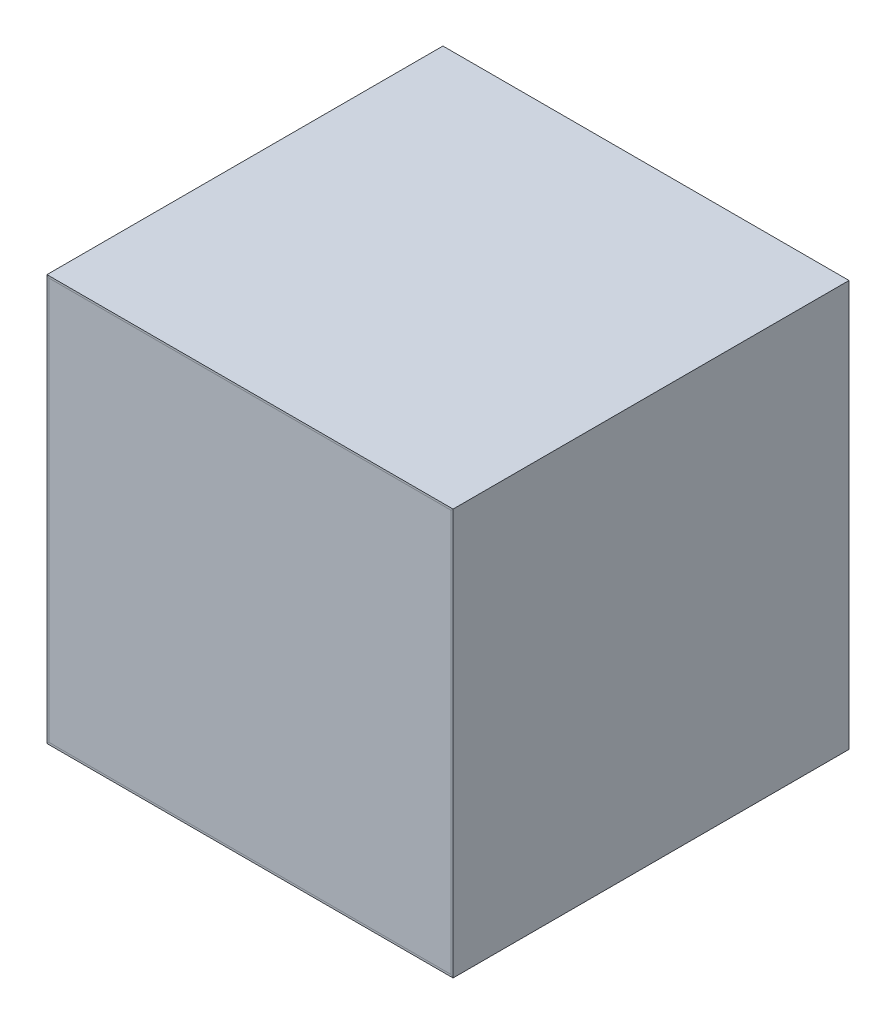
ISO-10303-21;
HEADER;
FILE_DESCRIPTION(('STEP AP214'),'2;1');
FILE_NAME('part.step','',(''),(''),'','','');
FILE_SCHEMA(('AUTOMOTIVE_DESIGN { 1 0 10303 214 1 1 1 1 }'));
ENDSEC;
DATA;
#1=APPLICATION_CONTEXT('core data for automotive mechanical design processes');
#2=APPLICATION_PROTOCOL_DEFINITION('international standard','automotive_design',2000,#1);
#3=PRODUCT_CONTEXT('',#1,'mechanical');
#4=PRODUCT('Part','Part','',(#3));
#5=PRODUCT_RELATED_PRODUCT_CATEGORY('part','',(#4));
#6=PRODUCT_DEFINITION_FORMATION('','',#4);
#7=PRODUCT_DEFINITION_CONTEXT('part definition',#1,'design');
#8=PRODUCT_DEFINITION('design','',#6,#7);
#9=PRODUCT_DEFINITION_SHAPE('','',#8);
#10=(LENGTH_UNIT() NAMED_UNIT(*) SI_UNIT(.MILLI.,.METRE.));
#11=(NAMED_UNIT(*) PLANE_ANGLE_UNIT() SI_UNIT($,.RADIAN.));
#12=(NAMED_UNIT(*) SI_UNIT($,.STERADIAN.) SOLID_ANGLE_UNIT());
#13=UNCERTAINTY_MEASURE_WITH_UNIT(LENGTH_MEASURE(1.E-05),#10,'distance_accuracy_value','');
#14=(GEOMETRIC_REPRESENTATION_CONTEXT(3) GLOBAL_UNCERTAINTY_ASSIGNED_CONTEXT((#13)) GLOBAL_UNIT_ASSIGNED_CONTEXT((#10,
#11,#12)) REPRESENTATION_CONTEXT('',''));
#15=CARTESIAN_POINT('',(0.,0.,0.));
#16=DIRECTION('',(0.,0.,1.));
#17=DIRECTION('',(1.,0.,0.));
#18=AXIS2_PLACEMENT_3D('',#15,#16,#17);
#19=CARTESIAN_POINT('',(299.538430706453,-299.538430706453,-9.67963308426285E-13));
#20=DIRECTION('',(0.707106781186547,-0.707106781186548,0.));
#21=DIRECTION('',(0.707106781186548,0.707106781186547,0.));
#22=AXIS2_PLACEMENT_3D('',#19,#20,#21);
#23=PLANE('',#22);
#24=DIRECTION('',(-0.707106781186548,-0.707106781186547,0.));
#25=VECTOR('',#24,1.);
#26=CARTESIAN_POINT('',(299.538430706453,-299.538430706453,25.0000000000121));
#27=LINE('',#26,#25);
#28=CARTESIAN_POINT('',(1099.47361403625,500.396752623344,25.0000000000121));
#29=VERTEX_POINT('',#28);
#30=CARTESIAN_POINT('',(1094.47361403625,495.396752623344,25.0000000000121));
#31=VERTEX_POINT('',#30);
#32=EDGE_CURVE('E145',#29,#31,#27,.T.);
#33=ORIENTED_EDGE('',*,*,#32,.F.);
#34=DIRECTION('',(0.,0.,1.));
#35=VECTOR('',#34,1.);
#36=CARTESIAN_POINT('',(1099.47361403625,500.396752623344,25.0000000000121));
#37=LINE('',#36,#35);
#38=CARTESIAN_POINT('',(1099.47361403625,500.396752623344,1000.00000000001));
#39=VERTEX_POINT('',#38);
#40=EDGE_CURVE('E135',#29,#39,#37,.T.);
#41=ORIENTED_EDGE('',*,*,#40,.T.);
#42=DIRECTION('',(-0.707106781186548,-0.707106781186547,0.));
#43=VECTOR('',#42,1.);
#44=CARTESIAN_POINT('',(299.538430706455,-299.538430706455,1000.00000000001));
#45=LINE('',#44,#43);
#46=CARTESIAN_POINT('',(1094.47361403625,495.396752623344,1000.00000000001));
#47=VERTEX_POINT('',#46);
#48=EDGE_CURVE('E125',#39,#47,#45,.T.);
#49=ORIENTED_EDGE('',*,*,#48,.T.);
#50=DIRECTION('',(0.,0.,1.));
#51=VECTOR('',#50,1.);
#52=CARTESIAN_POINT('',(1094.47361403625,495.396752623344,25.0000000000121));
#53=LINE('',#52,#51);
#54=EDGE_CURVE('E84',#31,#47,#53,.T.);
#55=ORIENTED_EDGE('',*,*,#54,.F.);
#56=EDGE_LOOP('',(#33,#41,#49,#55));
#57=FACE_BOUND('',#56,.T.);
#58=ADVANCED_FACE('F80',(#57),#23,.T.);
#59=CARTESIAN_POINT('',(299.973285714792,299.973285714792,1.05516752023136E-12));
#60=DIRECTION('',(-0.707106781186548,-0.707106781186547,0.));
#61=DIRECTION('',(0.707106781186547,-0.707106781186548,0.));
#62=AXIS2_PLACEMENT_3D('',#59,#60,#61);
#63=PLANE('',#62);
#64=DIRECTION('',(-0.707106781186547,0.707106781186548,0.));
#65=VECTOR('',#64,1.);
#66=CARTESIAN_POINT('',(299.97328571479,299.97328571479,1000.00000000001));
#67=LINE('',#66,#65);
#68=CARTESIAN_POINT('',(104.549818806238,495.396752623344,1000.00000000001));
#69=VERTEX_POINT('',#68);
#70=CARTESIAN_POINT('',(99.5498188062385,500.396752623344,1000.00000000001));
#71=VERTEX_POINT('',#70);
#72=EDGE_CURVE('E124',#69,#71,#67,.T.);
#73=ORIENTED_EDGE('',*,*,#72,.T.);
#74=DIRECTION('',(0.,0.,-1.));
#75=VECTOR('',#74,1.);
#76=CARTESIAN_POINT('',(99.5498188062401,500.396752623344,25.0000000000086));
#77=LINE('',#76,#75);
#78=CARTESIAN_POINT('',(99.5498188062385,500.396752623344,25.0000000000121));
#79=VERTEX_POINT('',#78);
#80=EDGE_CURVE('E134',#71,#79,#77,.T.);
#81=ORIENTED_EDGE('',*,*,#80,.T.);
#82=DIRECTION('',(-0.707106781186547,0.707106781186548,0.));
#83=VECTOR('',#82,1.);
#84=CARTESIAN_POINT('',(299.973285714792,299.973285714792,25.0000000000121));
#85=LINE('',#84,#83);
#86=CARTESIAN_POINT('',(104.549818806238,495.396752623344,25.0000000000121));
#87=VERTEX_POINT('',#86);
#88=EDGE_CURVE('E147',#87,#79,#85,.T.);
#89=ORIENTED_EDGE('',*,*,#88,.F.);
#90=DIRECTION('',(0.,0.,-1.));
#91=VECTOR('',#90,1.);
#92=CARTESIAN_POINT('',(104.54981880624,495.396752623344,25.0000000000086));
#93=LINE('',#92,#91);
#94=EDGE_CURVE('E97',#69,#87,#93,.T.);
#95=ORIENTED_EDGE('',*,*,#94,.F.);
#96=EDGE_LOOP('',(#73,#81,#89,#95));
#97=FACE_BOUND('',#96,.T.);
#98=ADVANCED_FACE('F133',(#97),#63,.T.);
#99=CARTESIAN_POINT('',(0.,0.,1000.00000000001));
#100=DIRECTION('',(0.,0.,-1.));
#101=DIRECTION('',(-1.,0.,0.));
#102=AXIS2_PLACEMENT_3D('',#99,#100,#101);
#103=PLANE('',#102);
#104=ORIENTED_EDGE('',*,*,#48,.F.);
#105=DIRECTION('',(1.,0.,0.));
#106=VECTOR('',#105,1.);
#107=CARTESIAN_POINT('',(1099.49321386162,500.396752623344,1000.00000000001));
#108=LINE('',#107,#106);
#109=EDGE_CURVE('E123',#71,#39,#108,.T.);
#110=ORIENTED_EDGE('',*,*,#109,.F.);
#111=ORIENTED_EDGE('',*,*,#72,.F.);
#112=DIRECTION('',(1.,0.,0.));
#113=VECTOR('',#112,1.);
#114=CARTESIAN_POINT('',(1099.49321386162,495.396752623344,1000.00000000001));
#115=LINE('',#114,#113);
#116=EDGE_CURVE('E13',#69,#47,#115,.T.);
#117=ORIENTED_EDGE('',*,*,#116,.T.);
#118=EDGE_LOOP('',(#104,#110,#111,#117));
#119=FACE_BOUND('',#118,.T.);
#120=ADVANCED_FACE('F82',(#119),#103,.F.);
#121=CARTESIAN_POINT('',(0.,0.,25.0000000000121));
#122=DIRECTION('',(0.,0.,-1.));
#123=DIRECTION('',(-1.,0.,0.));
#124=AXIS2_PLACEMENT_3D('',#121,#122,#123);
#125=PLANE('',#124);
#126=DIRECTION('',(1.,0.,0.));
#127=VECTOR('',#126,1.);
#128=CARTESIAN_POINT('',(1099.49321386162,500.396752623344,25.0000000000121));
#129=LINE('',#128,#127);
#130=EDGE_CURVE('E130',#79,#29,#129,.T.);
#131=ORIENTED_EDGE('',*,*,#130,.T.);
#132=ORIENTED_EDGE('',*,*,#32,.T.);
#133=DIRECTION('',(1.,0.,0.));
#134=VECTOR('',#133,1.);
#135=CARTESIAN_POINT('',(1099.49321386162,495.396752623344,25.0000000000121));
#136=LINE('',#135,#134);
#137=EDGE_CURVE('E89',#87,#31,#136,.T.);
#138=ORIENTED_EDGE('',*,*,#137,.F.);
#139=ORIENTED_EDGE('',*,*,#88,.T.);
#140=EDGE_LOOP('',(#131,#132,#138,#139));
#141=FACE_BOUND('',#140,.T.);
#142=ADVANCED_FACE('F153',(#141),#125,.T.);
#143=CARTESIAN_POINT('',(1099.49321386162,495.396752623344,25.0000000000121));
#144=DIRECTION('',(0.,-1.,0.));
#145=DIRECTION('',(0.,0.,-1.));
#146=AXIS2_PLACEMENT_3D('',#143,#144,#145);
#147=PLANE('',#146);
#148=ORIENTED_EDGE('',*,*,#137,.T.);
#149=ORIENTED_EDGE('',*,*,#54,.T.);
#150=ORIENTED_EDGE('',*,*,#116,.F.);
#151=ORIENTED_EDGE('',*,*,#94,.T.);
#152=EDGE_LOOP('',(#148,#149,#150,#151));
#153=FACE_BOUND('',#152,.T.);
#154=ADVANCED_FACE('F152',(#153),#147,.T.);
#155=CARTESIAN_POINT('',(1099.49321386162,500.396752623344,25.0000000000121));
#156=DIRECTION('',(0.,-1.,0.));
#157=DIRECTION('',(0.,0.,-1.));
#158=AXIS2_PLACEMENT_3D('',#155,#156,#157);
#159=PLANE('',#158);
#160=ORIENTED_EDGE('',*,*,#40,.F.);
#161=ORIENTED_EDGE('',*,*,#130,.F.);
#162=ORIENTED_EDGE('',*,*,#80,.F.);
#163=ORIENTED_EDGE('',*,*,#109,.T.);
#164=EDGE_LOOP('',(#160,#161,#162,#163));
#165=FACE_BOUND('',#164,.T.);
#166=ADVANCED_FACE('F137',(#165),#159,.F.);
#167=CLOSED_SHELL('',(#58,#98,#120,#142,#154,#166));
#168=MANIFOLD_SOLID_BREP('B2',#167);
#169=CARTESIAN_POINT('',(299.973285714792,299.973285714792,1.05516752023136E-12));
#170=DIRECTION('',(-0.707106781186548,-0.707106781186547,0.));
#171=DIRECTION('',(0.707106781186547,-0.707106781186548,0.));
#172=AXIS2_PLACEMENT_3D('',#169,#170,#171);
#173=PLANE('',#172);
#174=DIRECTION('',(-0.707106781186547,0.707106781186548,0.));
#175=VECTOR('',#174,1.);
#176=CARTESIAN_POINT('',(299.973285714792,299.973285714792,25.0000000000121));
#177=LINE('',#176,#175);
#178=CARTESIAN_POINT('',(1099.49321386162,-499.546642432042,25.0000000000121));
#179=VERTEX_POINT('',#178);
#180=CARTESIAN_POINT('',(1094.49321386162,-494.546642432042,25.0000000000121));
#181=VERTEX_POINT('',#180);
#182=EDGE_CURVE('E271',#179,#181,#177,.T.);
#183=ORIENTED_EDGE('',*,*,#182,.T.);
#184=DIRECTION('',(0.,0.,1.));
#185=VECTOR('',#184,1.);
#186=CARTESIAN_POINT('',(1094.49321386162,-494.54664243204,25.0000000000086));
#187=LINE('',#186,#185);
#188=CARTESIAN_POINT('',(1094.49321386162,-494.546642432042,1000.00000000001));
#189=VERTEX_POINT('',#188);
#190=EDGE_CURVE('E312',#181,#189,#187,.T.);
#191=ORIENTED_EDGE('',*,*,#190,.T.);
#192=DIRECTION('',(-0.707106781186547,0.707106781186548,0.));
#193=VECTOR('',#192,1.);
#194=CARTESIAN_POINT('',(299.97328571479,299.97328571479,1000.00000000001));
#195=LINE('',#194,#193);
#196=CARTESIAN_POINT('',(1099.49321386162,-499.546642432042,1000.00000000001));
#197=VERTEX_POINT('',#196);
#198=EDGE_CURVE('E305',#197,#189,#195,.T.);
#199=ORIENTED_EDGE('',*,*,#198,.F.);
#200=DIRECTION('',(0.,0.,1.));
#201=VECTOR('',#200,1.);
#202=CARTESIAN_POINT('',(1099.49321386162,-499.54664243204,25.0000000000086));
#203=LINE('',#202,#201);
#204=EDGE_CURVE('E214',#179,#197,#203,.T.);
#205=ORIENTED_EDGE('',*,*,#204,.F.);
#206=EDGE_LOOP('',(#183,#191,#199,#205));
#207=FACE_BOUND('',#206,.T.);
#208=ADVANCED_FACE('F210',(#207),#173,.F.);
#209=CARTESIAN_POINT('',(299.538430706453,-299.538430706453,-9.67963308426285E-13));
#210=DIRECTION('',(0.707106781186547,-0.707106781186548,0.));
#211=DIRECTION('',(0.707106781186548,0.707106781186547,0.));
#212=AXIS2_PLACEMENT_3D('',#209,#210,#211);
#213=PLANE('',#212);
#214=DIRECTION('',(-0.707106781186548,-0.707106781186547,0.));
#215=VECTOR('',#214,1.);
#216=CARTESIAN_POINT('',(299.538430706455,-299.538430706455,1000.00000000001));
#217=LINE('',#216,#215);
#218=CARTESIAN_POINT('',(104.493213861624,-494.583647551284,1000.00000000001));
#219=VERTEX_POINT('',#218);
#220=CARTESIAN_POINT('',(99.493213861624,-499.583647551284,1000.00000000001));
#221=VERTEX_POINT('',#220);
#222=EDGE_CURVE('E302',#219,#221,#217,.T.);
#223=ORIENTED_EDGE('',*,*,#222,.F.);
#224=DIRECTION('',(0.,0.,-1.));
#225=VECTOR('',#224,1.);
#226=CARTESIAN_POINT('',(104.493213861624,-494.583647551283,25.0000000000089));
#227=LINE('',#226,#225);
#228=CARTESIAN_POINT('',(104.493213861624,-494.583647551284,25.0000000000121));
#229=VERTEX_POINT('',#228);
#230=EDGE_CURVE('E309',#219,#229,#227,.T.);
#231=ORIENTED_EDGE('',*,*,#230,.T.);
#232=DIRECTION('',(-0.707106781186548,-0.707106781186547,0.));
#233=VECTOR('',#232,1.);
#234=CARTESIAN_POINT('',(299.538430706453,-299.538430706453,25.0000000000121));
#235=LINE('',#234,#233);
#236=CARTESIAN_POINT('',(99.493213861624,-499.583647551284,25.0000000000121));
#237=VERTEX_POINT('',#236);
#238=EDGE_CURVE('E306',#229,#237,#235,.T.);
#239=ORIENTED_EDGE('',*,*,#238,.T.);
#240=DIRECTION('',(0.,0.,-1.));
#241=VECTOR('',#240,1.);
#242=CARTESIAN_POINT('',(99.493213861624,-499.583647551283,25.0000000000089));
#243=LINE('',#242,#241);
#244=EDGE_CURVE('E284',#221,#237,#243,.T.);
#245=ORIENTED_EDGE('',*,*,#244,.F.);
#246=EDGE_LOOP('',(#223,#231,#239,#245));
#247=FACE_BOUND('',#246,.T.);
#248=ADVANCED_FACE('F353',(#247),#213,.F.);
#249=CARTESIAN_POINT('',(0.,0.,25.0000000000121));
#250=DIRECTION('',(0.,0.,-1.));
#251=DIRECTION('',(-1.,0.,0.));
#252=AXIS2_PLACEMENT_3D('',#249,#250,#251);
#253=PLANE('',#252);
#254=ORIENTED_EDGE('',*,*,#238,.F.);
#255=DIRECTION('',(0.,1.,0.));
#256=VECTOR('',#255,1.);
#257=CARTESIAN_POINT('',(104.493213861624,500.396752623344,25.0000000000121));
#258=LINE('',#257,#256);
#259=CARTESIAN_POINT('',(104.493213861624,-494.603247376656,25.0000000000121));
#260=VERTEX_POINT('',#259);
#261=EDGE_CURVE('E297',#260,#229,#258,.T.);
#262=ORIENTED_EDGE('',*,*,#261,.F.);
#263=DIRECTION('',(-1.,0.,0.));
#264=VECTOR('',#263,1.);
#265=CARTESIAN_POINT('',(1099.49321386162,-494.603247376656,25.0000000000121));
#266=LINE('',#265,#264);
#267=CARTESIAN_POINT('',(1094.49321386162,-494.603247376656,25.0000000000121));
#268=VERTEX_POINT('',#267);
#269=EDGE_CURVE('E238',#268,#260,#266,.T.);
#270=ORIENTED_EDGE('',*,*,#269,.F.);
#271=DIRECTION('',(0.,-1.,0.));
#272=VECTOR('',#271,1.);
#273=CARTESIAN_POINT('',(1094.49321386162,500.396752623344,25.0000000000121));
#274=LINE('',#273,#272);
#275=EDGE_CURVE('E300',#181,#268,#274,.T.);
#276=ORIENTED_EDGE('',*,*,#275,.F.);
#277=ORIENTED_EDGE('',*,*,#182,.F.);
#278=DIRECTION('',(0.,-1.,0.));
#279=VECTOR('',#278,1.);
#280=CARTESIAN_POINT('',(1099.49321386162,500.396752623344,25.0000000000121));
#281=LINE('',#280,#279);
#282=CARTESIAN_POINT('',(1099.49321386162,-499.603247376656,25.0000000000121));
#283=VERTEX_POINT('',#282);
#284=EDGE_CURVE('E262',#179,#283,#281,.T.);
#285=ORIENTED_EDGE('',*,*,#284,.T.);
#286=DIRECTION('',(-1.,0.,0.));
#287=VECTOR('',#286,1.);
#288=CARTESIAN_POINT('',(1099.49321386162,-499.603247376656,25.0000000000121));
#289=LINE('',#288,#287);
#290=CARTESIAN_POINT('',(99.493213861624,-499.603247376656,25.0000000000121));
#291=VERTEX_POINT('',#290);
#292=EDGE_CURVE('E266',#283,#291,#289,.T.);
#293=ORIENTED_EDGE('',*,*,#292,.T.);
#294=DIRECTION('',(0.,1.,0.));
#295=VECTOR('',#294,1.);
#296=CARTESIAN_POINT('',(99.493213861624,500.396752623344,25.0000000000121));
#297=LINE('',#296,#295);
#298=EDGE_CURVE('E281',#291,#237,#297,.T.);
#299=ORIENTED_EDGE('',*,*,#298,.T.);
#300=EDGE_LOOP('',(#254,#262,#270,#276,#277,#285,#293,#299));
#301=FACE_BOUND('',#300,.T.);
#302=ADVANCED_FACE('F212',(#301),#253,.T.);
#303=CARTESIAN_POINT('',(0.,0.,1000.00000000001));
#304=DIRECTION('',(0.,0.,-1.));
#305=DIRECTION('',(-1.,0.,0.));
#306=AXIS2_PLACEMENT_3D('',#303,#304,#305);
#307=PLANE('',#306);
#308=DIRECTION('',(0.,1.,0.));
#309=VECTOR('',#308,1.);
#310=CARTESIAN_POINT('',(104.493213861624,500.396752623344,1000.00000000001));
#311=LINE('',#310,#309);
#312=CARTESIAN_POINT('',(104.493213861624,-494.603247376656,1000.00000000001));
#313=VERTEX_POINT('',#312);
#314=EDGE_CURVE('E299',#313,#219,#311,.T.);
#315=ORIENTED_EDGE('',*,*,#314,.T.);
#316=ORIENTED_EDGE('',*,*,#222,.T.);
#317=DIRECTION('',(0.,1.,0.));
#318=VECTOR('',#317,1.);
#319=CARTESIAN_POINT('',(99.493213861624,500.396752623344,1000.00000000001));
#320=LINE('',#319,#318);
#321=CARTESIAN_POINT('',(99.493213861624,-499.603247376656,1000.00000000001));
#322=VERTEX_POINT('',#321);
#323=EDGE_CURVE('E272',#322,#221,#320,.T.);
#324=ORIENTED_EDGE('',*,*,#323,.F.);
#325=DIRECTION('',(-1.,0.,0.));
#326=VECTOR('',#325,1.);
#327=CARTESIAN_POINT('',(1099.49321386162,-499.603247376656,1000.00000000001));
#328=LINE('',#327,#326);
#329=CARTESIAN_POINT('',(1099.49321386162,-499.603247376656,1000.00000000001));
#330=VERTEX_POINT('',#329);
#331=EDGE_CURVE('E290',#330,#322,#328,.T.);
#332=ORIENTED_EDGE('',*,*,#331,.F.);
#333=DIRECTION('',(0.,-1.,0.));
#334=VECTOR('',#333,1.);
#335=CARTESIAN_POINT('',(1099.49321386162,500.396752623344,1000.00000000001));
#336=LINE('',#335,#334);
#337=EDGE_CURVE('E248',#197,#330,#336,.T.);
#338=ORIENTED_EDGE('',*,*,#337,.F.);
#339=ORIENTED_EDGE('',*,*,#198,.T.);
#340=DIRECTION('',(0.,-1.,0.));
#341=VECTOR('',#340,1.);
#342=CARTESIAN_POINT('',(1094.49321386162,500.396752623344,1000.00000000001));
#343=LINE('',#342,#341);
#344=CARTESIAN_POINT('',(1094.49321386162,-494.603247376656,1000.00000000001));
#345=VERTEX_POINT('',#344);
#346=EDGE_CURVE('E78',#189,#345,#343,.T.);
#347=ORIENTED_EDGE('',*,*,#346,.T.);
#348=DIRECTION('',(-1.,0.,0.));
#349=VECTOR('',#348,1.);
#350=CARTESIAN_POINT('',(1099.49321386162,-494.603247376656,1000.00000000001));
#351=LINE('',#350,#349);
#352=EDGE_CURVE('E220',#345,#313,#351,.T.);
#353=ORIENTED_EDGE('',*,*,#352,.T.);
#354=EDGE_LOOP('',(#315,#316,#324,#332,#338,#339,#347,#353));
#355=FACE_BOUND('',#354,.T.);
#356=ADVANCED_FACE('F332',(#355),#307,.F.);
#357=CARTESIAN_POINT('',(1099.49321386162,500.396752623344,25.0000000000121));
#358=DIRECTION('',(-1.,0.,0.));
#359=DIRECTION('',(0.,0.,1.));
#360=AXIS2_PLACEMENT_3D('',#357,#358,#359);
#361=PLANE('',#360);
#362=ORIENTED_EDGE('',*,*,#284,.F.);
#363=ORIENTED_EDGE('',*,*,#204,.T.);
#364=ORIENTED_EDGE('',*,*,#337,.T.);
#365=DIRECTION('',(0.,0.,1.));
#366=VECTOR('',#365,1.);
#367=CARTESIAN_POINT('',(1099.49321386162,-499.603247376656,25.0000000000121));
#368=LINE('',#367,#366);
#369=EDGE_CURVE('E277',#283,#330,#368,.T.);
#370=ORIENTED_EDGE('',*,*,#369,.F.);
#371=EDGE_LOOP('',(#362,#363,#364,#370));
#372=FACE_BOUND('',#371,.T.);
#373=ADVANCED_FACE('F283',(#372),#361,.F.);
#374=CARTESIAN_POINT('',(1099.49321386162,-499.603247376656,25.0000000000121));
#375=DIRECTION('',(0.,1.,0.));
#376=DIRECTION('',(0.,0.,1.));
#377=AXIS2_PLACEMENT_3D('',#374,#375,#376);
#378=PLANE('',#377);
#379=ORIENTED_EDGE('',*,*,#331,.T.);
#380=DIRECTION('',(0.,0.,1.));
#381=VECTOR('',#380,1.);
#382=CARTESIAN_POINT('',(99.493213861624,-499.603247376656,25.0000000000121));
#383=LINE('',#382,#381);
#384=EDGE_CURVE('E279',#291,#322,#383,.T.);
#385=ORIENTED_EDGE('',*,*,#384,.F.);
#386=ORIENTED_EDGE('',*,*,#292,.F.);
#387=ORIENTED_EDGE('',*,*,#369,.T.);
#388=EDGE_LOOP('',(#379,#385,#386,#387));
#389=FACE_BOUND('',#388,.T.);
#390=ADVANCED_FACE('F276',(#389),#378,.F.);
#391=CARTESIAN_POINT('',(99.493213861624,500.396752623344,25.0000000000121));
#392=DIRECTION('',(1.,0.,0.));
#393=DIRECTION('',(0.,0.,-1.));
#394=AXIS2_PLACEMENT_3D('',#391,#392,#393);
#395=PLANE('',#394);
#396=ORIENTED_EDGE('',*,*,#323,.T.);
#397=ORIENTED_EDGE('',*,*,#244,.T.);
#398=ORIENTED_EDGE('',*,*,#298,.F.);
#399=ORIENTED_EDGE('',*,*,#384,.T.);
#400=EDGE_LOOP('',(#396,#397,#398,#399));
#401=FACE_BOUND('',#400,.T.);
#402=ADVANCED_FACE('F335',(#401),#395,.F.);
#403=CARTESIAN_POINT('',(1094.49321386162,500.396752623344,25.0000000000121));
#404=DIRECTION('',(-1.,0.,0.));
#405=DIRECTION('',(0.,0.,1.));
#406=AXIS2_PLACEMENT_3D('',#403,#404,#405);
#407=PLANE('',#406);
#408=ORIENTED_EDGE('',*,*,#190,.F.);
#409=ORIENTED_EDGE('',*,*,#275,.T.);
#410=DIRECTION('',(0.,0.,1.));
#411=VECTOR('',#410,1.);
#412=CARTESIAN_POINT('',(1094.49321386162,-494.603247376656,25.0000000000121));
#413=LINE('',#412,#411);
#414=EDGE_CURVE('E292',#268,#345,#413,.T.);
#415=ORIENTED_EDGE('',*,*,#414,.T.);
#416=ORIENTED_EDGE('',*,*,#346,.F.);
#417=EDGE_LOOP('',(#408,#409,#415,#416));
#418=FACE_BOUND('',#417,.T.);
#419=ADVANCED_FACE('F356',(#418),#407,.T.);
#420=CARTESIAN_POINT('',(1099.49321386162,-494.603247376656,25.0000000000121));
#421=DIRECTION('',(0.,1.,0.));
#422=DIRECTION('',(0.,0.,1.));
#423=AXIS2_PLACEMENT_3D('',#420,#421,#422);
#424=PLANE('',#423);
#425=ORIENTED_EDGE('',*,*,#352,.F.);
#426=ORIENTED_EDGE('',*,*,#414,.F.);
#427=ORIENTED_EDGE('',*,*,#269,.T.);
#428=DIRECTION('',(0.,0.,1.));
#429=VECTOR('',#428,1.);
#430=CARTESIAN_POINT('',(104.493213861624,-494.603247376656,25.0000000000121));
#431=LINE('',#430,#429);
#432=EDGE_CURVE('E295',#260,#313,#431,.T.);
#433=ORIENTED_EDGE('',*,*,#432,.T.);
#434=EDGE_LOOP('',(#425,#426,#427,#433));
#435=FACE_BOUND('',#434,.T.);
#436=ADVANCED_FACE('F354',(#435),#424,.T.);
#437=CARTESIAN_POINT('',(104.493213861624,500.396752623344,25.0000000000121));
#438=DIRECTION('',(1.,0.,0.));
#439=DIRECTION('',(0.,0.,-1.));
#440=AXIS2_PLACEMENT_3D('',#437,#438,#439);
#441=PLANE('',#440);
#442=ORIENTED_EDGE('',*,*,#230,.F.);
#443=ORIENTED_EDGE('',*,*,#314,.F.);
#444=ORIENTED_EDGE('',*,*,#432,.F.);
#445=ORIENTED_EDGE('',*,*,#261,.T.);
#446=EDGE_LOOP('',(#442,#443,#444,#445));
#447=FACE_BOUND('',#446,.T.);
#448=ADVANCED_FACE('F351',(#447),#441,.T.);
#449=CLOSED_SHELL('',(#208,#248,#302,#356,#373,#390,#402,#419,#436,#448));
#450=MANIFOLD_SOLID_BREP('B7',#449);
#451=CARTESIAN_POINT('',(299.538430706453,-299.538430706453,-9.67963308426285E-13));
#452=DIRECTION('',(0.707106781186547,-0.707106781186548,0.));
#453=DIRECTION('',(0.707106781186548,0.707106781186547,0.));
#454=AXIS2_PLACEMENT_3D('',#451,#452,#453);
#455=PLANE('',#454);
#456=DIRECTION('',(-0.707106781186548,-0.707106781186547,0.));
#457=VECTOR('',#456,1.);
#458=CARTESIAN_POINT('',(299.538430706453,-299.538430706453,25.0000000000121));
#459=LINE('',#458,#457);
#460=CARTESIAN_POINT('',(1099.47361403625,500.396752623344,25.0000000000121));
#461=VERTEX_POINT('',#460);
#462=CARTESIAN_POINT('',(1094.47361403625,495.396752623344,25.0000000000121));
#463=VERTEX_POINT('',#462);
#464=EDGE_CURVE('E513',#461,#463,#459,.T.);
#465=ORIENTED_EDGE('',*,*,#464,.T.);
#466=DIRECTION('',(0.,0.,1.));
#467=VECTOR('',#466,1.);
#468=CARTESIAN_POINT('',(1094.47361403625,495.396752623344,25.0000000000121));
#469=LINE('',#468,#467);
#470=CARTESIAN_POINT('',(1094.47361403625,495.396752623344,1000.00000000001));
#471=VERTEX_POINT('',#470);
#472=EDGE_CURVE('E448',#463,#471,#469,.T.);
#473=ORIENTED_EDGE('',*,*,#472,.T.);
#474=DIRECTION('',(-0.707106781186548,-0.707106781186547,0.));
#475=VECTOR('',#474,1.);
#476=CARTESIAN_POINT('',(299.538430706455,-299.538430706455,1000.00000000001));
#477=LINE('',#476,#475);
#478=CARTESIAN_POINT('',(1099.47361403625,500.396752623344,1000.00000000001));
#479=VERTEX_POINT('',#478);
#480=EDGE_CURVE('E500',#479,#471,#477,.T.);
#481=ORIENTED_EDGE('',*,*,#480,.F.);
#482=DIRECTION('',(0.,0.,1.));
#483=VECTOR('',#482,1.);
#484=CARTESIAN_POINT('',(1099.47361403625,500.396752623344,25.0000000000121));
#485=LINE('',#484,#483);
#486=EDGE_CURVE('E508',#461,#479,#485,.T.);
#487=ORIENTED_EDGE('',*,*,#486,.F.);
#488=EDGE_LOOP('',(#465,#473,#481,#487));
#489=FACE_BOUND('',#488,.T.);
#490=ADVANCED_FACE('F444',(#489),#455,.F.);
#491=CARTESIAN_POINT('',(299.973285714792,299.973285714792,1.05516752023136E-12));
#492=DIRECTION('',(-0.707106781186548,-0.707106781186547,0.));
#493=DIRECTION('',(0.707106781186547,-0.707106781186548,0.));
#494=AXIS2_PLACEMENT_3D('',#491,#492,#493);
#495=PLANE('',#494);
#496=DIRECTION('',(-0.707106781186547,0.707106781186548,0.));
#497=VECTOR('',#496,1.);
#498=CARTESIAN_POINT('',(299.973285714792,299.973285714792,25.0000000000121));
#499=LINE('',#498,#497);
#500=CARTESIAN_POINT('',(1099.49321386162,-499.546642432042,25.0000000000121));
#501=VERTEX_POINT('',#500);
#502=CARTESIAN_POINT('',(1094.49321386162,-494.546642432042,25.0000000000121));
#503=VERTEX_POINT('',#502);
#504=EDGE_CURVE('E509',#501,#503,#499,.T.);
#505=ORIENTED_EDGE('',*,*,#504,.F.);
#506=DIRECTION('',(0.,0.,1.));
#507=VECTOR('',#506,1.);
#508=CARTESIAN_POINT('',(1099.49321386162,-499.54664243204,25.0000000000086));
#509=LINE('',#508,#507);
#510=CARTESIAN_POINT('',(1099.49321386162,-499.546642432042,1000.00000000001));
#511=VERTEX_POINT('',#510);
#512=EDGE_CURVE('E514',#501,#511,#509,.T.);
#513=ORIENTED_EDGE('',*,*,#512,.T.);
#514=DIRECTION('',(-0.707106781186547,0.707106781186548,0.));
#515=VECTOR('',#514,1.);
#516=CARTESIAN_POINT('',(299.97328571479,299.97328571479,1000.00000000001));
#517=LINE('',#516,#515);
#518=CARTESIAN_POINT('',(1094.49321386162,-494.546642432042,1000.00000000001));
#519=VERTEX_POINT('',#518);
#520=EDGE_CURVE('E525',#511,#519,#517,.T.);
#521=ORIENTED_EDGE('',*,*,#520,.T.);
#522=DIRECTION('',(0.,0.,1.));
#523=VECTOR('',#522,1.);
#524=CARTESIAN_POINT('',(1094.49321386162,-494.54664243204,25.0000000000086));
#525=LINE('',#524,#523);
#526=EDGE_CURVE('E543',#503,#519,#525,.T.);
#527=ORIENTED_EDGE('',*,*,#526,.F.);
#528=EDGE_LOOP('',(#505,#513,#521,#527));
#529=FACE_BOUND('',#528,.T.);
#530=ADVANCED_FACE('F531',(#529),#495,.T.);
#531=CARTESIAN_POINT('',(1099.49321386162,500.396752623344,25.0000000000121));
#532=DIRECTION('',(-1.,0.,0.));
#533=DIRECTION('',(0.,0.,1.));
#534=AXIS2_PLACEMENT_3D('',#531,#532,#533);
#535=PLANE('',#534);
#536=ORIENTED_EDGE('',*,*,#512,.F.);
#537=DIRECTION('',(0.,-1.,0.));
#538=VECTOR('',#537,1.);
#539=CARTESIAN_POINT('',(1099.49321386162,500.396752623344,25.0000000000121));
#540=LINE('',#539,#538);
#541=CARTESIAN_POINT('',(1099.49321386162,500.396752623344,25.0000000000121));
#542=VERTEX_POINT('',#541);
#543=EDGE_CURVE('E536',#542,#501,#540,.T.);
#544=ORIENTED_EDGE('',*,*,#543,.F.);
#545=DIRECTION('',(0.,0.,1.));
#546=VECTOR('',#545,1.);
#547=CARTESIAN_POINT('',(1099.49321386162,500.396752623344,25.0000000000121));
#548=LINE('',#547,#546);
#549=CARTESIAN_POINT('',(1099.49321386162,500.396752623344,1000.00000000001));
#550=VERTEX_POINT('',#549);
#551=EDGE_CURVE('E538',#542,#550,#548,.T.);
#552=ORIENTED_EDGE('',*,*,#551,.T.);
#553=DIRECTION('',(0.,-1.,0.));
#554=VECTOR('',#553,1.);
#555=CARTESIAN_POINT('',(1099.49321386162,500.396752623344,1000.00000000001));
#556=LINE('',#555,#554);
#557=EDGE_CURVE('E537',#550,#511,#556,.T.);
#558=ORIENTED_EDGE('',*,*,#557,.T.);
#559=EDGE_LOOP('',(#536,#544,#552,#558));
#560=FACE_BOUND('',#559,.T.);
#561=ADVANCED_FACE('F535',(#560),#535,.F.);
#562=CARTESIAN_POINT('',(0.,0.,1000.00000000001));
#563=DIRECTION('',(0.,0.,-1.));
#564=DIRECTION('',(-1.,0.,0.));
#565=AXIS2_PLACEMENT_3D('',#562,#563,#564);
#566=PLANE('',#565);
#567=ORIENTED_EDGE('',*,*,#520,.F.);
#568=ORIENTED_EDGE('',*,*,#557,.F.);
#569=DIRECTION('',(1.,0.,0.));
#570=VECTOR('',#569,1.);
#571=CARTESIAN_POINT('',(1099.49321386162,500.396752623344,1000.00000000001));
#572=LINE('',#571,#570);
#573=EDGE_CURVE('E470',#479,#550,#572,.T.);
#574=ORIENTED_EDGE('',*,*,#573,.F.);
#575=ORIENTED_EDGE('',*,*,#480,.T.);
#576=DIRECTION('',(1.,0.,0.));
#577=VECTOR('',#576,1.);
#578=CARTESIAN_POINT('',(1099.49321386162,495.396752623344,1000.00000000001));
#579=LINE('',#578,#577);
#580=CARTESIAN_POINT('',(1094.49321386162,495.396752623344,1000.00000000001));
#581=VERTEX_POINT('',#580);
#582=EDGE_CURVE('E453',#471,#581,#579,.T.);
#583=ORIENTED_EDGE('',*,*,#582,.T.);
#584=DIRECTION('',(0.,-1.,0.));
#585=VECTOR('',#584,1.);
#586=CARTESIAN_POINT('',(1094.49321386162,500.396752623344,1000.00000000001));
#587=LINE('',#586,#585);
#588=EDGE_CURVE('E208',#581,#519,#587,.T.);
#589=ORIENTED_EDGE('',*,*,#588,.T.);
#590=EDGE_LOOP('',(#567,#568,#574,#575,#583,#589));
#591=FACE_BOUND('',#590,.T.);
#592=ADVANCED_FACE('F503',(#591),#566,.F.);
#593=CARTESIAN_POINT('',(1094.49321386162,500.396752623344,25.0000000000121));
#594=DIRECTION('',(-1.,0.,0.));
#595=DIRECTION('',(0.,0.,1.));
#596=AXIS2_PLACEMENT_3D('',#593,#594,#595);
#597=PLANE('',#596);
#598=DIRECTION('',(0.,-1.,0.));
#599=VECTOR('',#598,1.);
#600=CARTESIAN_POINT('',(1094.49321386162,500.396752623344,25.0000000000121));
#601=LINE('',#600,#599);
#602=CARTESIAN_POINT('',(1094.49321386162,495.396752623344,25.0000000000121));
#603=VERTEX_POINT('',#602);
#604=EDGE_CURVE('E517',#603,#503,#601,.T.);
#605=ORIENTED_EDGE('',*,*,#604,.T.);
#606=ORIENTED_EDGE('',*,*,#526,.T.);
#607=ORIENTED_EDGE('',*,*,#588,.F.);
#608=DIRECTION('',(0.,0.,1.));
#609=VECTOR('',#608,1.);
#610=CARTESIAN_POINT('',(1094.49321386162,495.396752623344,25.0000000000121));
#611=LINE('',#610,#609);
#612=EDGE_CURVE('E516',#603,#581,#611,.T.);
#613=ORIENTED_EDGE('',*,*,#612,.F.);
#614=EDGE_LOOP('',(#605,#606,#607,#613));
#615=FACE_BOUND('',#614,.T.);
#616=ADVANCED_FACE('F541',(#615),#597,.T.);
#617=CARTESIAN_POINT('',(0.,0.,25.0000000000121));
#618=DIRECTION('',(0.,0.,-1.));
#619=DIRECTION('',(-1.,0.,0.));
#620=AXIS2_PLACEMENT_3D('',#617,#618,#619);
#621=PLANE('',#620);
#622=ORIENTED_EDGE('',*,*,#543,.T.);
#623=ORIENTED_EDGE('',*,*,#504,.T.);
#624=ORIENTED_EDGE('',*,*,#604,.F.);
#625=DIRECTION('',(1.,0.,0.));
#626=VECTOR('',#625,1.);
#627=CARTESIAN_POINT('',(1099.49321386162,495.396752623344,25.0000000000121));
#628=LINE('',#627,#626);
#629=EDGE_CURVE('E461',#463,#603,#628,.T.);
#630=ORIENTED_EDGE('',*,*,#629,.F.);
#631=ORIENTED_EDGE('',*,*,#464,.F.);
#632=DIRECTION('',(1.,0.,0.));
#633=VECTOR('',#632,1.);
#634=CARTESIAN_POINT('',(1099.49321386162,500.396752623344,25.0000000000121));
#635=LINE('',#634,#633);
#636=EDGE_CURVE('E545',#461,#542,#635,.T.);
#637=ORIENTED_EDGE('',*,*,#636,.T.);
#638=EDGE_LOOP('',(#622,#623,#624,#630,#631,#637));
#639=FACE_BOUND('',#638,.T.);
#640=ADVANCED_FACE('F553',(#639),#621,.T.);
#641=CARTESIAN_POINT('',(1099.49321386162,495.396752623344,25.0000000000121));
#642=DIRECTION('',(0.,-1.,0.));
#643=DIRECTION('',(0.,0.,-1.));
#644=AXIS2_PLACEMENT_3D('',#641,#642,#643);
#645=PLANE('',#644);
#646=ORIENTED_EDGE('',*,*,#472,.F.);
#647=ORIENTED_EDGE('',*,*,#629,.T.);
#648=ORIENTED_EDGE('',*,*,#612,.T.);
#649=ORIENTED_EDGE('',*,*,#582,.F.);
#650=EDGE_LOOP('',(#646,#647,#648,#649));
#651=FACE_BOUND('',#650,.T.);
#652=ADVANCED_FACE('F515',(#651),#645,.T.);
#653=CARTESIAN_POINT('',(1099.49321386162,500.396752623344,25.0000000000121));
#654=DIRECTION('',(0.,-1.,0.));
#655=DIRECTION('',(0.,0.,-1.));
#656=AXIS2_PLACEMENT_3D('',#653,#654,#655);
#657=PLANE('',#656);
#658=ORIENTED_EDGE('',*,*,#636,.F.);
#659=ORIENTED_EDGE('',*,*,#486,.T.);
#660=ORIENTED_EDGE('',*,*,#573,.T.);
#661=ORIENTED_EDGE('',*,*,#551,.F.);
#662=EDGE_LOOP('',(#658,#659,#660,#661));
#663=FACE_BOUND('',#662,.T.);
#664=ADVANCED_FACE('F446',(#663),#657,.F.);
#665=CLOSED_SHELL('',(#490,#530,#561,#592,#616,#640,#652,#664));
#666=MANIFOLD_SOLID_BREP('B72',#665);
#667=CARTESIAN_POINT('',(299.973285714792,299.973285714792,1.05516752023136E-12));
#668=DIRECTION('',(-0.707106781186548,-0.707106781186547,0.));
#669=DIRECTION('',(0.707106781186547,-0.707106781186548,0.));
#670=AXIS2_PLACEMENT_3D('',#667,#668,#669);
#671=PLANE('',#670);
#672=DIRECTION('',(-0.707106781186547,0.707106781186548,0.));
#673=VECTOR('',#672,1.);
#674=CARTESIAN_POINT('',(299.97328571479,299.97328571479,1000.00000000001));
#675=LINE('',#674,#673);
#676=CARTESIAN_POINT('',(104.549818806238,495.396752623344,1000.00000000001));
#677=VERTEX_POINT('',#676);
#678=CARTESIAN_POINT('',(99.5498188062385,500.396752623344,1000.00000000001));
#679=VERTEX_POINT('',#678);
#680=EDGE_CURVE('E717',#677,#679,#675,.T.);
#681=ORIENTED_EDGE('',*,*,#680,.F.);
#682=DIRECTION('',(0.,0.,-1.));
#683=VECTOR('',#682,1.);
#684=CARTESIAN_POINT('',(104.54981880624,495.396752623344,25.0000000000086));
#685=LINE('',#684,#683);
#686=CARTESIAN_POINT('',(104.549818806238,495.396752623344,25.0000000000121));
#687=VERTEX_POINT('',#686);
#688=EDGE_CURVE('E442',#677,#687,#685,.T.);
#689=ORIENTED_EDGE('',*,*,#688,.T.);
#690=DIRECTION('',(-0.707106781186547,0.707106781186548,0.));
#691=VECTOR('',#690,1.);
#692=CARTESIAN_POINT('',(299.973285714792,299.973285714792,25.0000000000121));
#693=LINE('',#692,#691);
#694=CARTESIAN_POINT('',(99.5498188062385,500.396752623344,25.0000000000121));
#695=VERTEX_POINT('',#694);
#696=EDGE_CURVE('E647',#687,#695,#693,.T.);
#697=ORIENTED_EDGE('',*,*,#696,.T.);
#698=DIRECTION('',(0.,0.,-1.));
#699=VECTOR('',#698,1.);
#700=CARTESIAN_POINT('',(99.5498188062401,500.396752623344,25.0000000000086));
#701=LINE('',#700,#699);
#702=EDGE_CURVE('E716',#679,#695,#701,.T.);
#703=ORIENTED_EDGE('',*,*,#702,.F.);
#704=EDGE_LOOP('',(#681,#689,#697,#703));
#705=FACE_BOUND('',#704,.T.);
#706=ADVANCED_FACE('F625',(#705),#671,.F.);
#707=CARTESIAN_POINT('',(299.538430706453,-299.538430706453,-9.67963308426285E-13));
#708=DIRECTION('',(0.707106781186547,-0.707106781186548,0.));
#709=DIRECTION('',(0.707106781186548,0.707106781186547,0.));
#710=AXIS2_PLACEMENT_3D('',#707,#708,#709);
#711=PLANE('',#710);
#712=DIRECTION('',(-0.707106781186548,-0.707106781186547,0.));
#713=VECTOR('',#712,1.);
#714=CARTESIAN_POINT('',(299.538430706455,-299.538430706455,1000.00000000001));
#715=LINE('',#714,#713);
#716=CARTESIAN_POINT('',(104.493213861624,-494.583647551284,1000.00000000001));
#717=VERTEX_POINT('',#716);
#718=CARTESIAN_POINT('',(99.493213861624,-499.583647551284,1000.00000000001));
#719=VERTEX_POINT('',#718);
#720=EDGE_CURVE('E687',#717,#719,#715,.T.);
#721=ORIENTED_EDGE('',*,*,#720,.T.);
#722=DIRECTION('',(0.,0.,-1.));
#723=VECTOR('',#722,1.);
#724=CARTESIAN_POINT('',(99.493213861624,-499.583647551283,25.0000000000089));
#725=LINE('',#724,#723);
#726=CARTESIAN_POINT('',(99.493213861624,-499.583647551284,25.0000000000121));
#727=VERTEX_POINT('',#726);
#728=EDGE_CURVE('E629',#719,#727,#725,.T.);
#729=ORIENTED_EDGE('',*,*,#728,.T.);
#730=DIRECTION('',(-0.707106781186548,-0.707106781186547,0.));
#731=VECTOR('',#730,1.);
#732=CARTESIAN_POINT('',(299.538430706453,-299.538430706453,25.0000000000121));
#733=LINE('',#732,#731);
#734=CARTESIAN_POINT('',(104.493213861624,-494.583647551284,25.0000000000121));
#735=VERTEX_POINT('',#734);
#736=EDGE_CURVE('E719',#735,#727,#733,.T.);
#737=ORIENTED_EDGE('',*,*,#736,.F.);
#738=DIRECTION('',(0.,0.,-1.));
#739=VECTOR('',#738,1.);
#740=CARTESIAN_POINT('',(104.493213861624,-494.583647551283,25.0000000000089));
#741=LINE('',#740,#739);
#742=EDGE_CURVE('E713',#717,#735,#741,.T.);
#743=ORIENTED_EDGE('',*,*,#742,.F.);
#744=EDGE_LOOP('',(#721,#729,#737,#743));
#745=FACE_BOUND('',#744,.T.);
#746=ADVANCED_FACE('F627',(#745),#711,.T.);
#747=CARTESIAN_POINT('',(99.493213861624,500.396752623344,25.0000000000121));
#748=DIRECTION('',(1.,0.,0.));
#749=DIRECTION('',(0.,0.,-1.));
#750=AXIS2_PLACEMENT_3D('',#747,#748,#749);
#751=PLANE('',#750);
#752=ORIENTED_EDGE('',*,*,#728,.F.);
#753=DIRECTION('',(0.,1.,0.));
#754=VECTOR('',#753,1.);
#755=CARTESIAN_POINT('',(99.493213861624,500.396752623344,1000.00000000001));
#756=LINE('',#755,#754);
#757=CARTESIAN_POINT('',(99.493213861624,500.396752623344,1000.00000000001));
#758=VERTEX_POINT('',#757);
#759=EDGE_CURVE('E695',#719,#758,#756,.T.);
#760=ORIENTED_EDGE('',*,*,#759,.T.);
#761=DIRECTION('',(0.,0.,1.));
#762=VECTOR('',#761,1.);
#763=CARTESIAN_POINT('',(99.493213861624,500.396752623344,25.0000000000121));
#764=LINE('',#763,#762);
#765=CARTESIAN_POINT('',(99.493213861624,500.396752623344,25.0000000000121));
#766=VERTEX_POINT('',#765);
#767=EDGE_CURVE('E708',#766,#758,#764,.T.);
#768=ORIENTED_EDGE('',*,*,#767,.F.);
#769=DIRECTION('',(0.,1.,0.));
#770=VECTOR('',#769,1.);
#771=CARTESIAN_POINT('',(99.493213861624,500.396752623344,25.0000000000121));
#772=LINE('',#771,#770);
#773=EDGE_CURVE('E703',#727,#766,#772,.T.);
#774=ORIENTED_EDGE('',*,*,#773,.F.);
#775=EDGE_LOOP('',(#752,#760,#768,#774));
#776=FACE_BOUND('',#775,.T.);
#777=ADVANCED_FACE('F730',(#776),#751,.F.);
#778=CARTESIAN_POINT('',(0.,0.,25.0000000000121));
#779=DIRECTION('',(0.,0.,-1.));
#780=DIRECTION('',(-1.,0.,0.));
#781=AXIS2_PLACEMENT_3D('',#778,#779,#780);
#782=PLANE('',#781);
#783=DIRECTION('',(0.,1.,0.));
#784=VECTOR('',#783,1.);
#785=CARTESIAN_POINT('',(104.493213861624,500.396752623344,25.0000000000121));
#786=LINE('',#785,#784);
#787=CARTESIAN_POINT('',(104.493213861624,495.396752623344,25.0000000000121));
#788=VERTEX_POINT('',#787);
#789=EDGE_CURVE('E694',#735,#788,#786,.T.);
#790=ORIENTED_EDGE('',*,*,#789,.F.);
#791=ORIENTED_EDGE('',*,*,#736,.T.);
#792=ORIENTED_EDGE('',*,*,#773,.T.);
#793=DIRECTION('',(1.,0.,0.));
#794=VECTOR('',#793,1.);
#795=CARTESIAN_POINT('',(1099.49321386162,500.396752623344,25.0000000000121));
#796=LINE('',#795,#794);
#797=EDGE_CURVE('E705',#766,#695,#796,.T.);
#798=ORIENTED_EDGE('',*,*,#797,.T.);
#799=ORIENTED_EDGE('',*,*,#696,.F.);
#800=DIRECTION('',(1.,0.,0.));
#801=VECTOR('',#800,1.);
#802=CARTESIAN_POINT('',(1099.49321386162,495.396752623344,25.0000000000121));
#803=LINE('',#802,#801);
#804=EDGE_CURVE('E696',#788,#687,#803,.T.);
#805=ORIENTED_EDGE('',*,*,#804,.F.);
#806=EDGE_LOOP('',(#790,#791,#792,#798,#799,#805));
#807=FACE_BOUND('',#806,.T.);
#808=ADVANCED_FACE('F725',(#807),#782,.T.);
#809=CARTESIAN_POINT('',(104.493213861624,500.396752623344,25.0000000000121));
#810=DIRECTION('',(1.,0.,0.));
#811=DIRECTION('',(0.,0.,-1.));
#812=AXIS2_PLACEMENT_3D('',#809,#810,#811);
#813=PLANE('',#812);
#814=DIRECTION('',(0.,1.,0.));
#815=VECTOR('',#814,1.);
#816=CARTESIAN_POINT('',(104.493213861624,500.396752623344,1000.00000000001));
#817=LINE('',#816,#815);
#818=CARTESIAN_POINT('',(104.493213861624,495.396752623344,1000.00000000001));
#819=VERTEX_POINT('',#818);
#820=EDGE_CURVE('E681',#717,#819,#817,.T.);
#821=ORIENTED_EDGE('',*,*,#820,.F.);
#822=ORIENTED_EDGE('',*,*,#742,.T.);
#823=ORIENTED_EDGE('',*,*,#789,.T.);
#824=DIRECTION('',(0.,0.,1.));
#825=VECTOR('',#824,1.);
#826=CARTESIAN_POINT('',(104.493213861624,495.396752623344,25.0000000000121));
#827=LINE('',#826,#825);
#828=EDGE_CURVE('E691',#788,#819,#827,.T.);
#829=ORIENTED_EDGE('',*,*,#828,.T.);
#830=EDGE_LOOP('',(#821,#822,#823,#829));
#831=FACE_BOUND('',#830,.T.);
#832=ADVANCED_FACE('F692',(#831),#813,.T.);
#833=CARTESIAN_POINT('',(0.,0.,1000.00000000001));
#834=DIRECTION('',(0.,0.,-1.));
#835=DIRECTION('',(-1.,0.,0.));
#836=AXIS2_PLACEMENT_3D('',#833,#834,#835);
#837=PLANE('',#836);
#838=ORIENTED_EDGE('',*,*,#720,.F.);
#839=ORIENTED_EDGE('',*,*,#820,.T.);
#840=DIRECTION('',(1.,0.,0.));
#841=VECTOR('',#840,1.);
#842=CARTESIAN_POINT('',(1099.49321386162,495.396752623344,1000.00000000001));
#843=LINE('',#842,#841);
#844=EDGE_CURVE('E685',#819,#677,#843,.T.);
#845=ORIENTED_EDGE('',*,*,#844,.T.);
#846=ORIENTED_EDGE('',*,*,#680,.T.);
#847=DIRECTION('',(1.,0.,0.));
#848=VECTOR('',#847,1.);
#849=CARTESIAN_POINT('',(1099.49321386162,500.396752623344,1000.00000000001));
#850=LINE('',#849,#848);
#851=EDGE_CURVE('E706',#758,#679,#850,.T.);
#852=ORIENTED_EDGE('',*,*,#851,.F.);
#853=ORIENTED_EDGE('',*,*,#759,.F.);
#854=EDGE_LOOP('',(#838,#839,#845,#846,#852,#853));
#855=FACE_BOUND('',#854,.T.);
#856=ADVANCED_FACE('F683',(#855),#837,.F.);
#857=CARTESIAN_POINT('',(1099.49321386162,495.396752623344,25.0000000000121));
#858=DIRECTION('',(0.,-1.,0.));
#859=DIRECTION('',(0.,0.,-1.));
#860=AXIS2_PLACEMENT_3D('',#857,#858,#859);
#861=PLANE('',#860);
#862=ORIENTED_EDGE('',*,*,#688,.F.);
#863=ORIENTED_EDGE('',*,*,#844,.F.);
#864=ORIENTED_EDGE('',*,*,#828,.F.);
#865=ORIENTED_EDGE('',*,*,#804,.T.);
#866=EDGE_LOOP('',(#862,#863,#864,#865));
#867=FACE_BOUND('',#866,.T.);
#868=ADVANCED_FACE('F698',(#867),#861,.T.);
#869=CARTESIAN_POINT('',(1099.49321386162,500.396752623344,25.0000000000121));
#870=DIRECTION('',(0.,-1.,0.));
#871=DIRECTION('',(0.,0.,-1.));
#872=AXIS2_PLACEMENT_3D('',#869,#870,#871);
#873=PLANE('',#872);
#874=ORIENTED_EDGE('',*,*,#851,.T.);
#875=ORIENTED_EDGE('',*,*,#702,.T.);
#876=ORIENTED_EDGE('',*,*,#797,.F.);
#877=ORIENTED_EDGE('',*,*,#767,.T.);
#878=EDGE_LOOP('',(#874,#875,#876,#877));
#879=FACE_BOUND('',#878,.T.);
#880=ADVANCED_FACE('F734',(#879),#873,.F.);
#881=CLOSED_SHELL('',(#706,#746,#777,#808,#832,#856,#868,#880));
#882=MANIFOLD_SOLID_BREP('B202',#881);
#883=CARTESIAN_POINT('',(104.493213861624,-494.603247376656,995.00000000001));
#884=DIRECTION('',(1.,0.,0.));
#885=DIRECTION('',(0.,0.,-1.));
#886=AXIS2_PLACEMENT_3D('',#883,#884,#885);
#887=PLANE('',#886);
#888=DIRECTION('',(0.,1.,0.));
#889=VECTOR('',#888,1.);
#890=CARTESIAN_POINT('',(104.493213861624,-494.603247376656,1000.00000000001));
#891=LINE('',#890,#889);
#892=CARTESIAN_POINT('',(104.493213861624,-494.603247376656,1000.00000000001));
#893=VERTEX_POINT('',#892);
#894=CARTESIAN_POINT('',(104.493213861624,495.396752623344,1000.00000000001));
#895=VERTEX_POINT('',#894);
#896=EDGE_CURVE('E860',#893,#895,#891,.T.);
#897=ORIENTED_EDGE('',*,*,#896,.T.);
#898=DIRECTION('',(0.,0.,1.));
#899=VECTOR('',#898,1.);
#900=CARTESIAN_POINT('',(104.493213861624,495.396752623344,995.00000000001));
#901=LINE('',#900,#899);
#902=CARTESIAN_POINT('',(104.493213861624,495.396752623344,995.00000000001));
#903=VERTEX_POINT('',#902);
#904=EDGE_CURVE('E623',#903,#895,#901,.T.);
#905=ORIENTED_EDGE('',*,*,#904,.F.);
#906=DIRECTION('',(0.,1.,0.));
#907=VECTOR('',#906,1.);
#908=CARTESIAN_POINT('',(104.493213861624,-494.603247376656,995.00000000001));
#909=LINE('',#908,#907);
#910=CARTESIAN_POINT('',(104.493213861624,-494.603247376656,995.00000000001));
#911=VERTEX_POINT('',#910);
#912=EDGE_CURVE('E848',#911,#903,#909,.T.);
#913=ORIENTED_EDGE('',*,*,#912,.F.);
#914=DIRECTION('',(0.,0.,1.));
#915=VECTOR('',#914,1.);
#916=CARTESIAN_POINT('',(104.493213861624,-494.603247376656,995.00000000001));
#917=LINE('',#916,#915);
#918=EDGE_CURVE('E856',#911,#893,#917,.T.);
#919=ORIENTED_EDGE('',*,*,#918,.T.);
#920=EDGE_LOOP('',(#897,#905,#913,#919));
#921=FACE_BOUND('',#920,.T.);
#922=ADVANCED_FACE('F797',(#921),#887,.F.);
#923=CARTESIAN_POINT('',(104.493213861624,495.396752623344,995.00000000001));
#924=DIRECTION('',(0.,-1.,0.));
#925=DIRECTION('',(0.,0.,-1.));
#926=AXIS2_PLACEMENT_3D('',#923,#924,#925);
#927=PLANE('',#926);
#928=DIRECTION('',(1.,0.,0.));
#929=VECTOR('',#928,1.);
#930=CARTESIAN_POINT('',(104.493213861624,495.396752623344,1000.00000000001));
#931=LINE('',#930,#929);
#932=CARTESIAN_POINT('',(1094.49321386162,495.396752623344,1000.00000000001));
#933=VERTEX_POINT('',#932);
#934=EDGE_CURVE('E852',#895,#933,#931,.T.);
#935=ORIENTED_EDGE('',*,*,#934,.T.);
#936=DIRECTION('',(0.,0.,1.));
#937=VECTOR('',#936,1.);
#938=CARTESIAN_POINT('',(1094.49321386162,495.396752623344,995.00000000001));
#939=LINE('',#938,#937);
#940=CARTESIAN_POINT('',(1094.49321386162,495.396752623344,995.00000000001));
#941=VERTEX_POINT('',#940);
#942=EDGE_CURVE('E805',#941,#933,#939,.T.);
#943=ORIENTED_EDGE('',*,*,#942,.F.);
#944=DIRECTION('',(1.,0.,0.));
#945=VECTOR('',#944,1.);
#946=CARTESIAN_POINT('',(104.493213861624,495.396752623344,995.00000000001));
#947=LINE('',#946,#945);
#948=EDGE_CURVE('E843',#903,#941,#947,.T.);
#949=ORIENTED_EDGE('',*,*,#948,.F.);
#950=ORIENTED_EDGE('',*,*,#904,.T.);
#951=EDGE_LOOP('',(#935,#943,#949,#950));
#952=FACE_BOUND('',#951,.T.);
#953=ADVANCED_FACE('F851',(#952),#927,.F.);
#954=CARTESIAN_POINT('',(1094.49321386162,-494.603247376656,995.00000000001));
#955=DIRECTION('',(-1.,0.,0.));
#956=DIRECTION('',(0.,0.,1.));
#957=AXIS2_PLACEMENT_3D('',#954,#955,#956);
#958=PLANE('',#957);
#959=DIRECTION('',(0.,-1.,0.));
#960=VECTOR('',#959,1.);
#961=CARTESIAN_POINT('',(1094.49321386162,-494.603247376656,1000.00000000001));
#962=LINE('',#961,#960);
#963=CARTESIAN_POINT('',(1094.49321386162,-494.603247376656,1000.00000000001));
#964=VERTEX_POINT('',#963);
#965=EDGE_CURVE('E830',#933,#964,#962,.T.);
#966=ORIENTED_EDGE('',*,*,#965,.T.);
#967=DIRECTION('',(0.,0.,1.));
#968=VECTOR('',#967,1.);
#969=CARTESIAN_POINT('',(1094.49321386162,-494.603247376656,995.00000000001));
#970=LINE('',#969,#968);
#971=CARTESIAN_POINT('',(1094.49321386162,-494.603247376656,995.00000000001));
#972=VERTEX_POINT('',#971);
#973=EDGE_CURVE('E853',#972,#964,#970,.T.);
#974=ORIENTED_EDGE('',*,*,#973,.F.);
#975=DIRECTION('',(0.,-1.,0.));
#976=VECTOR('',#975,1.);
#977=CARTESIAN_POINT('',(1094.49321386162,-494.603247376656,995.00000000001));
#978=LINE('',#977,#976);
#979=EDGE_CURVE('E846',#941,#972,#978,.T.);
#980=ORIENTED_EDGE('',*,*,#979,.F.);
#981=ORIENTED_EDGE('',*,*,#942,.T.);
#982=EDGE_LOOP('',(#966,#974,#980,#981));
#983=FACE_BOUND('',#982,.T.);
#984=ADVANCED_FACE('F854',(#983),#958,.F.);
#985=CARTESIAN_POINT('',(104.493213861624,-494.603247376656,995.00000000001));
#986=DIRECTION('',(0.,1.,0.));
#987=DIRECTION('',(0.,0.,1.));
#988=AXIS2_PLACEMENT_3D('',#985,#986,#987);
#989=PLANE('',#988);
#990=DIRECTION('',(-1.,0.,0.));
#991=VECTOR('',#990,1.);
#992=CARTESIAN_POINT('',(104.493213861624,-494.603247376656,1000.00000000001));
#993=LINE('',#992,#991);
#994=EDGE_CURVE('E836',#964,#893,#993,.T.);
#995=ORIENTED_EDGE('',*,*,#994,.T.);
#996=ORIENTED_EDGE('',*,*,#918,.F.);
#997=DIRECTION('',(-1.,0.,0.));
#998=VECTOR('',#997,1.);
#999=CARTESIAN_POINT('',(104.493213861624,-494.603247376656,995.00000000001));
#1000=LINE('',#999,#998);
#1001=EDGE_CURVE('E813',#972,#911,#1000,.T.);
#1002=ORIENTED_EDGE('',*,*,#1001,.F.);
#1003=ORIENTED_EDGE('',*,*,#973,.T.);
#1004=EDGE_LOOP('',(#995,#996,#1002,#1003));
#1005=FACE_BOUND('',#1004,.T.);
#1006=ADVANCED_FACE('F867',(#1005),#989,.F.);
#1007=CARTESIAN_POINT('',(0.,0.,995.00000000001));
#1008=DIRECTION('',(0.,0.,-1.));
#1009=DIRECTION('',(-1.,0.,0.));
#1010=AXIS2_PLACEMENT_3D('',#1007,#1008,#1009);
#1011=PLANE('',#1010);
#1012=ORIENTED_EDGE('',*,*,#912,.T.);
#1013=ORIENTED_EDGE('',*,*,#948,.T.);
#1014=ORIENTED_EDGE('',*,*,#979,.T.);
#1015=ORIENTED_EDGE('',*,*,#1001,.T.);
#1016=EDGE_LOOP('',(#1012,#1013,#1014,#1015));
#1017=FACE_BOUND('',#1016,.T.);
#1018=ADVANCED_FACE('F844',(#1017),#1011,.T.);
#1019=CARTESIAN_POINT('',(0.,0.,1000.00000000001));
#1020=DIRECTION('',(0.,0.,-1.));
#1021=DIRECTION('',(-1.,0.,0.));
#1022=AXIS2_PLACEMENT_3D('',#1019,#1020,#1021);
#1023=PLANE('',#1022);
#1024=ORIENTED_EDGE('',*,*,#896,.F.);
#1025=ORIENTED_EDGE('',*,*,#994,.F.);
#1026=ORIENTED_EDGE('',*,*,#965,.F.);
#1027=ORIENTED_EDGE('',*,*,#934,.F.);
#1028=EDGE_LOOP('',(#1024,#1025,#1026,#1027));
#1029=FACE_BOUND('',#1028,.T.);
#1030=ADVANCED_FACE('F870',(#1029),#1023,.F.);
#1031=CLOSED_SHELL('',(#922,#953,#984,#1006,#1018,#1030));
#1032=MANIFOLD_SOLID_BREP('B436_NOT_SHOWN',#1031);
#1033=ADVANCED_BREP_SHAPE_REPRESENTATION('',(#18,#168,#450,#666,#882,#1032),#14);
#1034=SHAPE_DEFINITION_REPRESENTATION(#9,#1033);
ENDSEC;
END-ISO-10303-21;
